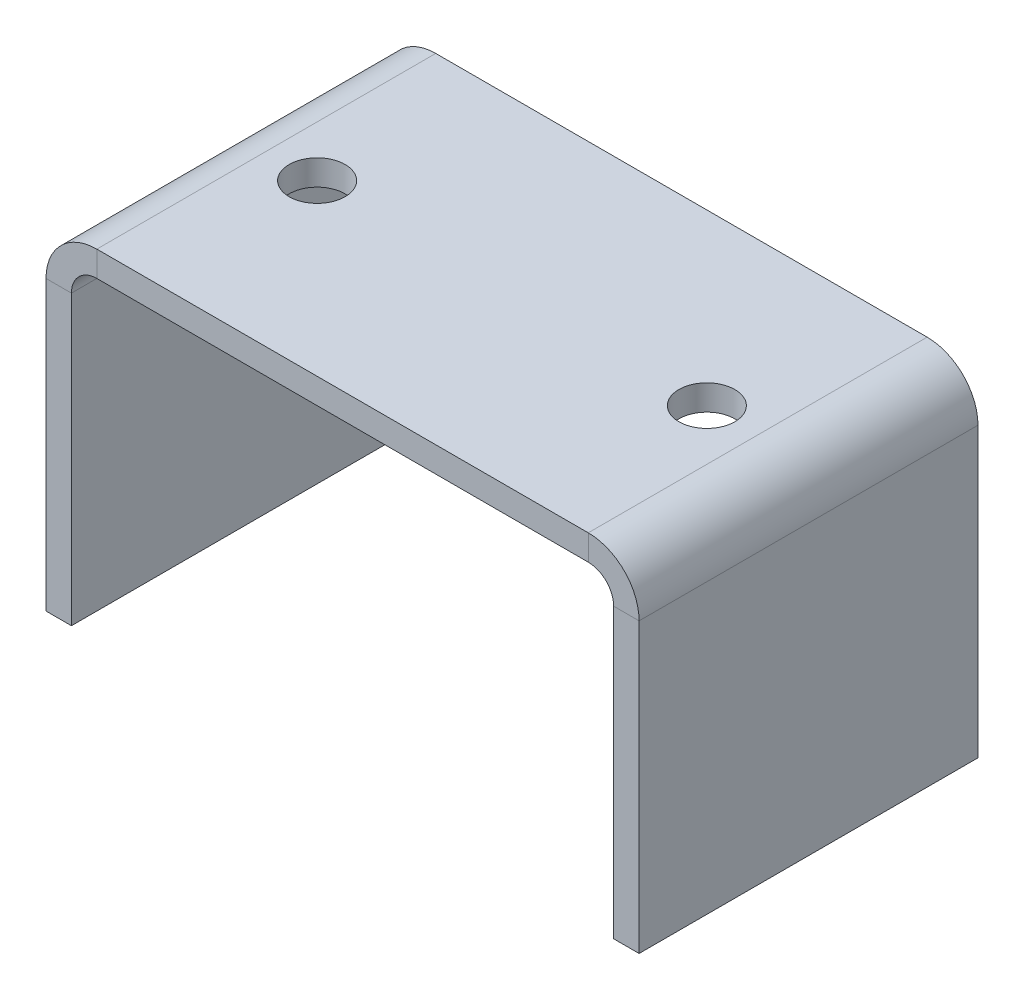
ISO-10303-21;
HEADER;
FILE_DESCRIPTION(('STEP AP214'),'2;1');
FILE_NAME('part.step','',(''),(''),'','','');
FILE_SCHEMA(('AUTOMOTIVE_DESIGN { 1 0 10303 214 1 1 1 1 }'));
ENDSEC;
DATA;
#1=APPLICATION_CONTEXT('core data for automotive mechanical design processes');
#2=APPLICATION_PROTOCOL_DEFINITION('international standard','automotive_design',2000,#1);
#3=PRODUCT_CONTEXT('',#1,'mechanical');
#4=PRODUCT('Part','Part','',(#3));
#5=PRODUCT_RELATED_PRODUCT_CATEGORY('part','',(#4));
#6=PRODUCT_DEFINITION_FORMATION('','',#4);
#7=PRODUCT_DEFINITION_CONTEXT('part definition',#1,'design');
#8=PRODUCT_DEFINITION('design','',#6,#7);
#9=PRODUCT_DEFINITION_SHAPE('','',#8);
#10=(LENGTH_UNIT() NAMED_UNIT(*) SI_UNIT(.MILLI.,.METRE.));
#11=(NAMED_UNIT(*) PLANE_ANGLE_UNIT() SI_UNIT($,.RADIAN.));
#12=(NAMED_UNIT(*) SI_UNIT($,.STERADIAN.) SOLID_ANGLE_UNIT());
#13=UNCERTAINTY_MEASURE_WITH_UNIT(LENGTH_MEASURE(1.E-05),#10,'distance_accuracy_value','');
#14=(GEOMETRIC_REPRESENTATION_CONTEXT(3) GLOBAL_UNCERTAINTY_ASSIGNED_CONTEXT((#13)) GLOBAL_UNIT_ASSIGNED_CONTEXT((#10,
#11,#12)) REPRESENTATION_CONTEXT('',''));
#15=CARTESIAN_POINT('',(0.,0.,0.));
#16=DIRECTION('',(0.,0.,1.));
#17=DIRECTION('',(1.,0.,0.));
#18=AXIS2_PLACEMENT_3D('',#15,#16,#17);
#19=CARTESIAN_POINT('',(6.,40.,20.));
#20=DIRECTION('',(0.,0.,1.));
#21=DIRECTION('',(1.,0.,0.));
#22=AXIS2_PLACEMENT_3D('',#19,#20,#21);
#23=PLANE('',#22);
#24=DIRECTION('',(0.,-1.,0.));
#25=VECTOR('',#24,1.);
#26=CARTESIAN_POINT('',(6.,40.,20.));
#27=LINE('',#26,#25);
#28=CARTESIAN_POINT('',(6.,40.,20.));
#29=VERTEX_POINT('',#28);
#30=CARTESIAN_POINT('',(6.,37.,20.));
#31=VERTEX_POINT('',#30);
#32=EDGE_CURVE('E11',#29,#31,#27,.T.);
#33=ORIENTED_EDGE('',*,*,#32,.F.);
#34=CARTESIAN_POINT('',(6.,34.,20.));
#35=DIRECTION('',(0.,0.,1.));
#36=DIRECTION('',(1.,0.,0.));
#37=AXIS2_PLACEMENT_3D('',#34,#35,#36);
#38=CIRCLE('',#37,6.);
#39=CARTESIAN_POINT('',(0.,34.,20.));
#40=VERTEX_POINT('',#39);
#41=EDGE_CURVE('E250',#40,#29,#38,.F.);
#42=ORIENTED_EDGE('',*,*,#41,.F.);
#43=DIRECTION('',(-1.,0.,0.));
#44=VECTOR('',#43,1.);
#45=CARTESIAN_POINT('',(3.,34.,20.));
#46=LINE('',#45,#44);
#47=CARTESIAN_POINT('',(3.,34.,20.));
#48=VERTEX_POINT('',#47);
#49=EDGE_CURVE('E47',#48,#40,#46,.T.);
#50=ORIENTED_EDGE('',*,*,#49,.F.);
#51=CARTESIAN_POINT('',(6.,34.,20.));
#52=DIRECTION('',(0.,0.,1.));
#53=DIRECTION('',(1.,0.,0.));
#54=AXIS2_PLACEMENT_3D('',#51,#52,#53);
#55=CIRCLE('',#54,3.);
#56=EDGE_CURVE('E148',#48,#31,#55,.F.);
#57=ORIENTED_EDGE('',*,*,#56,.T.);
#58=EDGE_LOOP('',(#33,#42,#50,#57));
#59=FACE_BOUND('',#58,.T.);
#60=ADVANCED_FACE('F39',(#59),#23,.T.);
#61=CARTESIAN_POINT('',(3.,34.,20.));
#62=DIRECTION('',(0.,0.,1.));
#63=DIRECTION('',(1.,0.,0.));
#64=AXIS2_PLACEMENT_3D('',#61,#62,#63);
#65=PLANE('',#64);
#66=DIRECTION('',(1.,0.,0.));
#67=VECTOR('',#66,1.);
#68=CARTESIAN_POINT('',(0.,40.,20.));
#69=LINE('',#68,#67);
#70=CARTESIAN_POINT('',(64.,40.,20.));
#71=VERTEX_POINT('',#70);
#72=EDGE_CURVE('E142',#29,#71,#69,.T.);
#73=ORIENTED_EDGE('',*,*,#72,.F.);
#74=ORIENTED_EDGE('',*,*,#32,.T.);
#75=DIRECTION('',(1.,0.,0.));
#76=VECTOR('',#75,1.);
#77=CARTESIAN_POINT('',(0.,37.,20.));
#78=LINE('',#77,#76);
#79=CARTESIAN_POINT('',(64.,37.,20.));
#80=VERTEX_POINT('',#79);
#81=EDGE_CURVE('E139',#31,#80,#78,.T.);
#82=ORIENTED_EDGE('',*,*,#81,.T.);
#83=DIRECTION('',(0.,1.,0.));
#84=VECTOR('',#83,1.);
#85=CARTESIAN_POINT('',(64.,37.,20.));
#86=LINE('',#85,#84);
#87=EDGE_CURVE('E231',#80,#71,#86,.T.);
#88=ORIENTED_EDGE('',*,*,#87,.T.);
#89=EDGE_LOOP('',(#73,#74,#82,#88));
#90=FACE_BOUND('',#89,.T.);
#91=ADVANCED_FACE('F137',(#90),#65,.T.);
#92=CARTESIAN_POINT('',(0.,34.,-20.));
#93=DIRECTION('',(0.,0.,-1.));
#94=DIRECTION('',(-1.,0.,0.));
#95=AXIS2_PLACEMENT_3D('',#92,#93,#94);
#96=PLANE('',#95);
#97=DIRECTION('',(1.,0.,0.));
#98=VECTOR('',#97,1.);
#99=CARTESIAN_POINT('',(0.,34.,-20.));
#100=LINE('',#99,#98);
#101=CARTESIAN_POINT('',(0.,34.,-20.));
#102=VERTEX_POINT('',#101);
#103=CARTESIAN_POINT('',(3.,34.,-20.));
#104=VERTEX_POINT('',#103);
#105=EDGE_CURVE('E236',#102,#104,#100,.T.);
#106=ORIENTED_EDGE('',*,*,#105,.F.);
#107=CARTESIAN_POINT('',(6.,34.,-20.));
#108=DIRECTION('',(0.,0.,1.));
#109=DIRECTION('',(1.,0.,0.));
#110=AXIS2_PLACEMENT_3D('',#107,#108,#109);
#111=CIRCLE('',#110,6.);
#112=CARTESIAN_POINT('',(6.,40.,-20.));
#113=VERTEX_POINT('',#112);
#114=EDGE_CURVE('E188',#102,#113,#111,.F.);
#115=ORIENTED_EDGE('',*,*,#114,.T.);
#116=DIRECTION('',(0.,1.,0.));
#117=VECTOR('',#116,1.);
#118=CARTESIAN_POINT('',(6.,37.,-20.));
#119=LINE('',#118,#117);
#120=CARTESIAN_POINT('',(6.,37.,-20.));
#121=VERTEX_POINT('',#120);
#122=EDGE_CURVE('E234',#121,#113,#119,.T.);
#123=ORIENTED_EDGE('',*,*,#122,.F.);
#124=CARTESIAN_POINT('',(6.,34.,-20.));
#125=DIRECTION('',(0.,0.,1.));
#126=DIRECTION('',(1.,0.,0.));
#127=AXIS2_PLACEMENT_3D('',#124,#125,#126);
#128=CIRCLE('',#127,3.);
#129=EDGE_CURVE('E160',#104,#121,#128,.F.);
#130=ORIENTED_EDGE('',*,*,#129,.F.);
#131=EDGE_LOOP('',(#106,#115,#123,#130));
#132=FACE_BOUND('',#131,.T.);
#133=ADVANCED_FACE('F296',(#132),#96,.T.);
#134=CARTESIAN_POINT('',(6.,37.,-20.));
#135=DIRECTION('',(0.,0.,-1.));
#136=DIRECTION('',(-1.,0.,0.));
#137=AXIS2_PLACEMENT_3D('',#134,#135,#136);
#138=PLANE('',#137);
#139=DIRECTION('',(0.,1.,0.));
#140=VECTOR('',#139,1.);
#141=CARTESIAN_POINT('',(0.,0.,-20.));
#142=LINE('',#141,#140);
#143=CARTESIAN_POINT('',(0.,0.,-20.));
#144=VERTEX_POINT('',#143);
#145=EDGE_CURVE('E191',#144,#102,#142,.T.);
#146=ORIENTED_EDGE('',*,*,#145,.T.);
#147=ORIENTED_EDGE('',*,*,#105,.T.);
#148=DIRECTION('',(0.,1.,0.));
#149=VECTOR('',#148,1.);
#150=CARTESIAN_POINT('',(3.,0.,-20.));
#151=LINE('',#150,#149);
#152=CARTESIAN_POINT('',(3.,0.,-20.));
#153=VERTEX_POINT('',#152);
#154=EDGE_CURVE('E197',#153,#104,#151,.T.);
#155=ORIENTED_EDGE('',*,*,#154,.F.);
#156=DIRECTION('',(-1.,0.,0.));
#157=VECTOR('',#156,1.);
#158=CARTESIAN_POINT('',(3.,0.,-20.));
#159=LINE('',#158,#157);
#160=EDGE_CURVE('E194',#153,#144,#159,.T.);
#161=ORIENTED_EDGE('',*,*,#160,.T.);
#162=EDGE_LOOP('',(#146,#147,#155,#161));
#163=FACE_BOUND('',#162,.T.);
#164=ADVANCED_FACE('F299',(#163),#138,.T.);
#165=CARTESIAN_POINT('',(70.,34.,20.));
#166=DIRECTION('',(0.,0.,1.));
#167=DIRECTION('',(1.,0.,0.));
#168=AXIS2_PLACEMENT_3D('',#165,#166,#167);
#169=PLANE('',#168);
#170=DIRECTION('',(-1.,0.,0.));
#171=VECTOR('',#170,1.);
#172=CARTESIAN_POINT('',(70.,34.,20.));
#173=LINE('',#172,#171);
#174=CARTESIAN_POINT('',(70.,34.,20.));
#175=VERTEX_POINT('',#174);
#176=CARTESIAN_POINT('',(67.,34.,20.));
#177=VERTEX_POINT('',#176);
#178=EDGE_CURVE('E55',#175,#177,#173,.T.);
#179=ORIENTED_EDGE('',*,*,#178,.F.);
#180=CARTESIAN_POINT('',(64.,34.,20.));
#181=DIRECTION('',(0.,0.,1.));
#182=DIRECTION('',(1.,0.,0.));
#183=AXIS2_PLACEMENT_3D('',#180,#181,#182);
#184=CIRCLE('',#183,6.);
#185=EDGE_CURVE('E260',#71,#175,#184,.F.);
#186=ORIENTED_EDGE('',*,*,#185,.F.);
#187=ORIENTED_EDGE('',*,*,#87,.F.);
#188=CARTESIAN_POINT('',(64.,34.,20.));
#189=DIRECTION('',(0.,0.,1.));
#190=DIRECTION('',(1.,0.,0.));
#191=AXIS2_PLACEMENT_3D('',#188,#189,#190);
#192=CIRCLE('',#191,3.);
#193=EDGE_CURVE('E168',#80,#177,#192,.F.);
#194=ORIENTED_EDGE('',*,*,#193,.T.);
#195=EDGE_LOOP('',(#179,#186,#187,#194));
#196=FACE_BOUND('',#195,.T.);
#197=ADVANCED_FACE('F324',(#196),#169,.T.);
#198=CARTESIAN_POINT('',(64.,37.,20.));
#199=DIRECTION('',(0.,0.,1.));
#200=DIRECTION('',(1.,0.,0.));
#201=AXIS2_PLACEMENT_3D('',#198,#199,#200);
#202=PLANE('',#201);
#203=DIRECTION('',(0.,-1.,0.));
#204=VECTOR('',#203,1.);
#205=CARTESIAN_POINT('',(70.,40.,20.));
#206=LINE('',#205,#204);
#207=CARTESIAN_POINT('',(70.,0.,20.));
#208=VERTEX_POINT('',#207);
#209=EDGE_CURVE('E263',#175,#208,#206,.T.);
#210=ORIENTED_EDGE('',*,*,#209,.F.);
#211=ORIENTED_EDGE('',*,*,#178,.T.);
#212=DIRECTION('',(0.,1.,0.));
#213=VECTOR('',#212,1.);
#214=CARTESIAN_POINT('',(67.,40.,20.));
#215=LINE('',#214,#213);
#216=CARTESIAN_POINT('',(67.,0.,20.));
#217=VERTEX_POINT('',#216);
#218=EDGE_CURVE('E109',#177,#217,#215,.F.);
#219=ORIENTED_EDGE('',*,*,#218,.T.);
#220=DIRECTION('',(-1.,0.,0.));
#221=VECTOR('',#220,1.);
#222=CARTESIAN_POINT('',(70.,0.,20.));
#223=LINE('',#222,#221);
#224=EDGE_CURVE('E266',#208,#217,#223,.T.);
#225=ORIENTED_EDGE('',*,*,#224,.F.);
#226=EDGE_LOOP('',(#210,#211,#219,#225));
#227=FACE_BOUND('',#226,.T.);
#228=ADVANCED_FACE('F327',(#227),#202,.T.);
#229=CARTESIAN_POINT('',(64.,40.,-20.));
#230=DIRECTION('',(0.,0.,-1.));
#231=DIRECTION('',(-1.,0.,0.));
#232=AXIS2_PLACEMENT_3D('',#229,#230,#231);
#233=PLANE('',#232);
#234=DIRECTION('',(0.,-1.,0.));
#235=VECTOR('',#234,1.);
#236=CARTESIAN_POINT('',(64.,40.,-20.));
#237=LINE('',#236,#235);
#238=CARTESIAN_POINT('',(64.,40.,-20.));
#239=VERTEX_POINT('',#238);
#240=CARTESIAN_POINT('',(64.,37.,-20.));
#241=VERTEX_POINT('',#240);
#242=EDGE_CURVE('E96',#239,#241,#237,.T.);
#243=ORIENTED_EDGE('',*,*,#242,.F.);
#244=CARTESIAN_POINT('',(64.,34.,-20.));
#245=DIRECTION('',(0.,0.,1.));
#246=DIRECTION('',(1.,0.,0.));
#247=AXIS2_PLACEMENT_3D('',#244,#245,#246);
#248=CIRCLE('',#247,6.);
#249=CARTESIAN_POINT('',(70.,34.,-20.));
#250=VERTEX_POINT('',#249);
#251=EDGE_CURVE('E184',#239,#250,#248,.F.);
#252=ORIENTED_EDGE('',*,*,#251,.T.);
#253=DIRECTION('',(1.,0.,0.));
#254=VECTOR('',#253,1.);
#255=CARTESIAN_POINT('',(67.,34.,-20.));
#256=LINE('',#255,#254);
#257=CARTESIAN_POINT('',(67.,34.,-20.));
#258=VERTEX_POINT('',#257);
#259=EDGE_CURVE('E103',#258,#250,#256,.T.);
#260=ORIENTED_EDGE('',*,*,#259,.F.);
#261=CARTESIAN_POINT('',(64.,34.,-20.));
#262=DIRECTION('',(0.,0.,1.));
#263=DIRECTION('',(1.,0.,0.));
#264=AXIS2_PLACEMENT_3D('',#261,#262,#263);
#265=CIRCLE('',#264,3.);
#266=EDGE_CURVE('E203',#241,#258,#265,.F.);
#267=ORIENTED_EDGE('',*,*,#266,.F.);
#268=EDGE_LOOP('',(#243,#252,#260,#267));
#269=FACE_BOUND('',#268,.T.);
#270=ADVANCED_FACE('F331',(#269),#233,.T.);
#271=CARTESIAN_POINT('',(67.,34.,-20.));
#272=DIRECTION('',(0.,0.,-1.));
#273=DIRECTION('',(-1.,0.,0.));
#274=AXIS2_PLACEMENT_3D('',#271,#272,#273);
#275=PLANE('',#274);
#276=DIRECTION('',(1.,0.,0.));
#277=VECTOR('',#276,1.);
#278=CARTESIAN_POINT('',(0.,40.,-20.));
#279=LINE('',#278,#277);
#280=EDGE_CURVE('E186',#113,#239,#279,.T.);
#281=ORIENTED_EDGE('',*,*,#280,.T.);
#282=ORIENTED_EDGE('',*,*,#242,.T.);
#283=DIRECTION('',(1.,0.,0.));
#284=VECTOR('',#283,1.);
#285=CARTESIAN_POINT('',(0.,37.,-20.));
#286=LINE('',#285,#284);
#287=EDGE_CURVE('E201',#121,#241,#286,.T.);
#288=ORIENTED_EDGE('',*,*,#287,.F.);
#289=ORIENTED_EDGE('',*,*,#122,.T.);
#290=EDGE_LOOP('',(#281,#282,#288,#289));
#291=FACE_BOUND('',#290,.T.);
#292=ADVANCED_FACE('F334',(#291),#275,.T.);
#293=CARTESIAN_POINT('',(67.,40.,20.));
#294=DIRECTION('',(1.,0.,0.));
#295=DIRECTION('',(0.,0.,-1.));
#296=AXIS2_PLACEMENT_3D('',#293,#294,#295);
#297=PLANE('',#296);
#298=DIRECTION('',(0.,1.,0.));
#299=VECTOR('',#298,1.);
#300=CARTESIAN_POINT('',(67.,40.,-20.));
#301=LINE('',#300,#299);
#302=CARTESIAN_POINT('',(67.,0.,-20.));
#303=VERTEX_POINT('',#302);
#304=EDGE_CURVE('E174',#258,#303,#301,.F.);
#305=ORIENTED_EDGE('',*,*,#304,.T.);
#306=DIRECTION('',(0.,0.,-1.));
#307=VECTOR('',#306,1.);
#308=CARTESIAN_POINT('',(67.,0.,20.));
#309=LINE('',#308,#307);
#310=EDGE_CURVE('E227',#217,#303,#309,.T.);
#311=ORIENTED_EDGE('',*,*,#310,.F.);
#312=ORIENTED_EDGE('',*,*,#218,.F.);
#313=DIRECTION('',(0.,0.,-1.));
#314=VECTOR('',#313,1.);
#315=CARTESIAN_POINT('',(67.,34.,20.));
#316=LINE('',#315,#314);
#317=EDGE_CURVE('E170',#177,#258,#316,.T.);
#318=ORIENTED_EDGE('',*,*,#317,.T.);
#319=EDGE_LOOP('',(#305,#311,#312,#318));
#320=FACE_BOUND('',#319,.T.);
#321=ADVANCED_FACE('F337',(#320),#297,.F.);
#322=CARTESIAN_POINT('',(70.,0.,20.));
#323=DIRECTION('',(0.,-1.,0.));
#324=DIRECTION('',(0.,0.,-1.));
#325=AXIS2_PLACEMENT_3D('',#322,#323,#324);
#326=PLANE('',#325);
#327=DIRECTION('',(-1.,0.,0.));
#328=VECTOR('',#327,1.);
#329=CARTESIAN_POINT('',(70.,0.,-20.));
#330=LINE('',#329,#328);
#331=CARTESIAN_POINT('',(70.,0.,-20.));
#332=VERTEX_POINT('',#331);
#333=EDGE_CURVE('E177',#332,#303,#330,.T.);
#334=ORIENTED_EDGE('',*,*,#333,.F.);
#335=DIRECTION('',(0.,0.,-1.));
#336=VECTOR('',#335,1.);
#337=CARTESIAN_POINT('',(70.,0.,20.));
#338=LINE('',#337,#336);
#339=EDGE_CURVE('E225',#208,#332,#338,.T.);
#340=ORIENTED_EDGE('',*,*,#339,.F.);
#341=ORIENTED_EDGE('',*,*,#224,.T.);
#342=ORIENTED_EDGE('',*,*,#310,.T.);
#343=EDGE_LOOP('',(#334,#340,#341,#342));
#344=FACE_BOUND('',#343,.T.);
#345=ADVANCED_FACE('F340',(#344),#326,.T.);
#346=CARTESIAN_POINT('',(70.,40.,20.));
#347=DIRECTION('',(1.,0.,0.));
#348=DIRECTION('',(0.,0.,-1.));
#349=AXIS2_PLACEMENT_3D('',#346,#347,#348);
#350=PLANE('',#349);
#351=DIRECTION('',(0.,-1.,0.));
#352=VECTOR('',#351,1.);
#353=CARTESIAN_POINT('',(70.,40.,-20.));
#354=LINE('',#353,#352);
#355=EDGE_CURVE('E181',#250,#332,#354,.T.);
#356=ORIENTED_EDGE('',*,*,#355,.F.);
#357=DIRECTION('',(0.,0.,-1.));
#358=VECTOR('',#357,1.);
#359=CARTESIAN_POINT('',(70.,34.,20.));
#360=LINE('',#359,#358);
#361=EDGE_CURVE('E222',#175,#250,#360,.T.);
#362=ORIENTED_EDGE('',*,*,#361,.F.);
#363=ORIENTED_EDGE('',*,*,#209,.T.);
#364=ORIENTED_EDGE('',*,*,#339,.T.);
#365=EDGE_LOOP('',(#356,#362,#363,#364));
#366=FACE_BOUND('',#365,.T.);
#367=ADVANCED_FACE('F344',(#366),#350,.T.);
#368=CARTESIAN_POINT('',(64.,34.,20.));
#369=DIRECTION('',(0.,0.,-1.));
#370=DIRECTION('',(-1.,0.,0.));
#371=AXIS2_PLACEMENT_3D('',#368,#369,#370);
#372=CYLINDRICAL_SURFACE('',#371,6.);
#373=ORIENTED_EDGE('',*,*,#251,.F.);
#374=DIRECTION('',(0.,0.,-1.));
#375=VECTOR('',#374,1.);
#376=CARTESIAN_POINT('',(64.,40.,20.));
#377=LINE('',#376,#375);
#378=EDGE_CURVE('E219',#71,#239,#377,.T.);
#379=ORIENTED_EDGE('',*,*,#378,.F.);
#380=ORIENTED_EDGE('',*,*,#185,.T.);
#381=ORIENTED_EDGE('',*,*,#361,.T.);
#382=EDGE_LOOP('',(#373,#379,#380,#381));
#383=FACE_BOUND('',#382,.T.);
#384=ADVANCED_FACE('F288',(#383),#372,.T.);
#385=CARTESIAN_POINT('',(0.,40.,20.));
#386=DIRECTION('',(0.,1.,0.));
#387=DIRECTION('',(0.,0.,1.));
#388=AXIS2_PLACEMENT_3D('',#385,#386,#387);
#389=PLANE('',#388);
#390=CARTESIAN_POINT('',(12.,40.,0.));
#391=DIRECTION('',(0.,1.,0.));
#392=DIRECTION('',(0.,0.,1.));
#393=AXIS2_PLACEMENT_3D('',#390,#391,#392);
#394=CIRCLE('',#393,3.3);
#395=CARTESIAN_POINT('',(12.,40.,3.3));
#396=VERTEX_POINT('',#395);
#397=EDGE_CURVE('E278',#396,#396,#394,.T.);
#398=ORIENTED_EDGE('',*,*,#397,.F.);
#399=EDGE_LOOP('',(#398));
#400=FACE_BOUND('',#399,.T.);
#401=CARTESIAN_POINT('',(58.,40.,0.));
#402=DIRECTION('',(0.,1.,0.));
#403=DIRECTION('',(0.,0.,1.));
#404=AXIS2_PLACEMENT_3D('',#401,#402,#403);
#405=CIRCLE('',#404,3.3);
#406=CARTESIAN_POINT('',(58.,40.,3.3));
#407=VERTEX_POINT('',#406);
#408=EDGE_CURVE('E272',#407,#407,#405,.T.);
#409=ORIENTED_EDGE('',*,*,#408,.F.);
#410=EDGE_LOOP('',(#409));
#411=FACE_BOUND('',#410,.T.);
#412=ORIENTED_EDGE('',*,*,#280,.F.);
#413=DIRECTION('',(0.,0.,-1.));
#414=VECTOR('',#413,1.);
#415=CARTESIAN_POINT('',(6.,40.,20.));
#416=LINE('',#415,#414);
#417=EDGE_CURVE('E216',#29,#113,#416,.T.);
#418=ORIENTED_EDGE('',*,*,#417,.F.);
#419=ORIENTED_EDGE('',*,*,#72,.T.);
#420=ORIENTED_EDGE('',*,*,#378,.T.);
#421=EDGE_LOOP('',(#412,#418,#419,#420));
#422=FACE_BOUND('',#421,.T.);
#423=ADVANCED_FACE('F285',(#400,#411,#422),#389,.T.);
#424=CARTESIAN_POINT('',(6.,34.,20.));
#425=DIRECTION('',(0.,0.,-1.));
#426=DIRECTION('',(-1.,0.,0.));
#427=AXIS2_PLACEMENT_3D('',#424,#425,#426);
#428=CYLINDRICAL_SURFACE('',#427,6.);
#429=ORIENTED_EDGE('',*,*,#114,.F.);
#430=DIRECTION('',(0.,0.,-1.));
#431=VECTOR('',#430,1.);
#432=CARTESIAN_POINT('',(0.,34.,20.));
#433=LINE('',#432,#431);
#434=EDGE_CURVE('E213',#40,#102,#433,.T.);
#435=ORIENTED_EDGE('',*,*,#434,.F.);
#436=ORIENTED_EDGE('',*,*,#41,.T.);
#437=ORIENTED_EDGE('',*,*,#417,.T.);
#438=EDGE_LOOP('',(#429,#435,#436,#437));
#439=FACE_BOUND('',#438,.T.);
#440=ADVANCED_FACE('F249',(#439),#428,.T.);
#441=CARTESIAN_POINT('',(0.,0.,20.));
#442=DIRECTION('',(-1.,0.,0.));
#443=DIRECTION('',(0.,0.,1.));
#444=AXIS2_PLACEMENT_3D('',#441,#442,#443);
#445=PLANE('',#444);
#446=ORIENTED_EDGE('',*,*,#145,.F.);
#447=DIRECTION('',(0.,0.,-1.));
#448=VECTOR('',#447,1.);
#449=CARTESIAN_POINT('',(0.,0.,20.));
#450=LINE('',#449,#448);
#451=CARTESIAN_POINT('',(0.,0.,20.));
#452=VERTEX_POINT('',#451);
#453=EDGE_CURVE('E211',#452,#144,#450,.T.);
#454=ORIENTED_EDGE('',*,*,#453,.F.);
#455=DIRECTION('',(0.,1.,0.));
#456=VECTOR('',#455,1.);
#457=CARTESIAN_POINT('',(0.,0.,20.));
#458=LINE('',#457,#456);
#459=EDGE_CURVE('E243',#452,#40,#458,.T.);
#460=ORIENTED_EDGE('',*,*,#459,.T.);
#461=ORIENTED_EDGE('',*,*,#434,.T.);
#462=EDGE_LOOP('',(#446,#454,#460,#461));
#463=FACE_BOUND('',#462,.T.);
#464=ADVANCED_FACE('F254',(#463),#445,.T.);
#465=CARTESIAN_POINT('',(3.,0.,20.));
#466=DIRECTION('',(0.,-1.,0.));
#467=DIRECTION('',(0.,0.,-1.));
#468=AXIS2_PLACEMENT_3D('',#465,#466,#467);
#469=PLANE('',#468);
#470=ORIENTED_EDGE('',*,*,#160,.F.);
#471=DIRECTION('',(0.,0.,-1.));
#472=VECTOR('',#471,1.);
#473=CARTESIAN_POINT('',(3.,0.,20.));
#474=LINE('',#473,#472);
#475=CARTESIAN_POINT('',(3.,0.,20.));
#476=VERTEX_POINT('',#475);
#477=EDGE_CURVE('E209',#476,#153,#474,.T.);
#478=ORIENTED_EDGE('',*,*,#477,.F.);
#479=DIRECTION('',(-1.,0.,0.));
#480=VECTOR('',#479,1.);
#481=CARTESIAN_POINT('',(3.,0.,20.));
#482=LINE('',#481,#480);
#483=EDGE_CURVE('E255',#476,#452,#482,.T.);
#484=ORIENTED_EDGE('',*,*,#483,.T.);
#485=ORIENTED_EDGE('',*,*,#453,.T.);
#486=EDGE_LOOP('',(#470,#478,#484,#485));
#487=FACE_BOUND('',#486,.T.);
#488=ADVANCED_FACE('F304',(#487),#469,.T.);
#489=CARTESIAN_POINT('',(3.,0.,20.));
#490=DIRECTION('',(-1.,0.,0.));
#491=DIRECTION('',(0.,0.,1.));
#492=AXIS2_PLACEMENT_3D('',#489,#490,#491);
#493=PLANE('',#492);
#494=ORIENTED_EDGE('',*,*,#154,.T.);
#495=DIRECTION('',(0.,0.,-1.));
#496=VECTOR('',#495,1.);
#497=CARTESIAN_POINT('',(3.,34.,20.));
#498=LINE('',#497,#496);
#499=EDGE_CURVE('E162',#48,#104,#498,.T.);
#500=ORIENTED_EDGE('',*,*,#499,.F.);
#501=DIRECTION('',(0.,1.,0.));
#502=VECTOR('',#501,1.);
#503=CARTESIAN_POINT('',(3.,0.,20.));
#504=LINE('',#503,#502);
#505=EDGE_CURVE('E153',#476,#48,#504,.T.);
#506=ORIENTED_EDGE('',*,*,#505,.F.);
#507=ORIENTED_EDGE('',*,*,#477,.T.);
#508=EDGE_LOOP('',(#494,#500,#506,#507));
#509=FACE_BOUND('',#508,.T.);
#510=ADVANCED_FACE('F302',(#509),#493,.F.);
#511=CARTESIAN_POINT('',(6.,34.,20.));
#512=DIRECTION('',(0.,0.,-1.));
#513=DIRECTION('',(-1.,0.,0.));
#514=AXIS2_PLACEMENT_3D('',#511,#512,#513);
#515=CYLINDRICAL_SURFACE('',#514,3.);
#516=ORIENTED_EDGE('',*,*,#129,.T.);
#517=DIRECTION('',(0.,0.,-1.));
#518=VECTOR('',#517,1.);
#519=CARTESIAN_POINT('',(6.,37.,20.));
#520=LINE('',#519,#518);
#521=EDGE_CURVE('E157',#31,#121,#520,.T.);
#522=ORIENTED_EDGE('',*,*,#521,.F.);
#523=ORIENTED_EDGE('',*,*,#56,.F.);
#524=ORIENTED_EDGE('',*,*,#499,.T.);
#525=EDGE_LOOP('',(#516,#522,#523,#524));
#526=FACE_BOUND('',#525,.T.);
#527=ADVANCED_FACE('F158',(#526),#515,.F.);
#528=CARTESIAN_POINT('',(0.,37.,20.));
#529=DIRECTION('',(0.,1.,0.));
#530=DIRECTION('',(0.,0.,1.));
#531=AXIS2_PLACEMENT_3D('',#528,#529,#530);
#532=PLANE('',#531);
#533=CARTESIAN_POINT('',(12.,37.,0.));
#534=DIRECTION('',(0.,1.,0.));
#535=DIRECTION('',(0.,0.,1.));
#536=AXIS2_PLACEMENT_3D('',#533,#534,#535);
#537=CIRCLE('',#536,3.29999999999999);
#538=CARTESIAN_POINT('',(12.,37.,3.29999999999999));
#539=VERTEX_POINT('',#538);
#540=EDGE_CURVE('E275',#539,#539,#537,.T.);
#541=ORIENTED_EDGE('',*,*,#540,.T.);
#542=EDGE_LOOP('',(#541));
#543=FACE_BOUND('',#542,.T.);
#544=CARTESIAN_POINT('',(58.,37.,0.));
#545=DIRECTION('',(0.,1.,0.));
#546=DIRECTION('',(0.,0.,1.));
#547=AXIS2_PLACEMENT_3D('',#544,#545,#546);
#548=CIRCLE('',#547,3.29999999999999);
#549=CARTESIAN_POINT('',(58.,37.,3.29999999999999));
#550=VERTEX_POINT('',#549);
#551=EDGE_CURVE('E178',#550,#550,#548,.T.);
#552=ORIENTED_EDGE('',*,*,#551,.T.);
#553=EDGE_LOOP('',(#552));
#554=FACE_BOUND('',#553,.T.);
#555=ORIENTED_EDGE('',*,*,#287,.T.);
#556=DIRECTION('',(0.,0.,-1.));
#557=VECTOR('',#556,1.);
#558=CARTESIAN_POINT('',(64.,37.,20.));
#559=LINE('',#558,#557);
#560=EDGE_CURVE('E163',#80,#241,#559,.T.);
#561=ORIENTED_EDGE('',*,*,#560,.F.);
#562=ORIENTED_EDGE('',*,*,#81,.F.);
#563=ORIENTED_EDGE('',*,*,#521,.T.);
#564=EDGE_LOOP('',(#555,#561,#562,#563));
#565=FACE_BOUND('',#564,.T.);
#566=ADVANCED_FACE('F165',(#543,#554,#565),#532,.F.);
#567=CARTESIAN_POINT('',(64.,34.,20.));
#568=DIRECTION('',(0.,0.,-1.));
#569=DIRECTION('',(-1.,0.,0.));
#570=AXIS2_PLACEMENT_3D('',#567,#568,#569);
#571=CYLINDRICAL_SURFACE('',#570,3.);
#572=ORIENTED_EDGE('',*,*,#266,.T.);
#573=ORIENTED_EDGE('',*,*,#317,.F.);
#574=ORIENTED_EDGE('',*,*,#193,.F.);
#575=ORIENTED_EDGE('',*,*,#560,.T.);
#576=EDGE_LOOP('',(#572,#573,#574,#575));
#577=FACE_BOUND('',#576,.T.);
#578=ADVANCED_FACE('F391',(#577),#571,.F.);
#579=CARTESIAN_POINT('',(64.,34.,20.));
#580=DIRECTION('',(0.,0.,1.));
#581=DIRECTION('',(1.,0.,0.));
#582=AXIS2_PLACEMENT_3D('',#579,#580,#581);
#583=PLANE('',#582);
#584=ORIENTED_EDGE('',*,*,#505,.T.);
#585=ORIENTED_EDGE('',*,*,#49,.T.);
#586=ORIENTED_EDGE('',*,*,#459,.F.);
#587=ORIENTED_EDGE('',*,*,#483,.F.);
#588=EDGE_LOOP('',(#584,#585,#586,#587));
#589=FACE_BOUND('',#588,.T.);
#590=ADVANCED_FACE('F240',(#589),#583,.T.);
#591=CARTESIAN_POINT('',(64.,34.,-20.));
#592=DIRECTION('',(0.,0.,1.));
#593=DIRECTION('',(1.,0.,0.));
#594=AXIS2_PLACEMENT_3D('',#591,#592,#593);
#595=PLANE('',#594);
#596=ORIENTED_EDGE('',*,*,#304,.F.);
#597=ORIENTED_EDGE('',*,*,#259,.T.);
#598=ORIENTED_EDGE('',*,*,#355,.T.);
#599=ORIENTED_EDGE('',*,*,#333,.T.);
#600=EDGE_LOOP('',(#596,#597,#598,#599));
#601=FACE_BOUND('',#600,.T.);
#602=ADVANCED_FACE('F406',(#601),#595,.F.);
#603=CARTESIAN_POINT('',(58.,40.,0.));
#604=DIRECTION('',(0.,1.,0.));
#605=DIRECTION('',(0.,0.,1.));
#606=AXIS2_PLACEMENT_3D('',#603,#604,#605);
#607=CYLINDRICAL_SURFACE('',#606,3.29999999999999);
#608=ORIENTED_EDGE('',*,*,#408,.T.);
#609=EDGE_LOOP('',(#608));
#610=FACE_BOUND('',#609,.T.);
#611=ORIENTED_EDGE('',*,*,#551,.F.);
#612=EDGE_LOOP('',(#611));
#613=FACE_BOUND('',#612,.T.);
#614=ADVANCED_FACE('F415',(#610,#613),#607,.F.);
#615=CARTESIAN_POINT('',(12.,40.,0.));
#616=DIRECTION('',(0.,1.,0.));
#617=DIRECTION('',(0.,0.,1.));
#618=AXIS2_PLACEMENT_3D('',#615,#616,#617);
#619=CYLINDRICAL_SURFACE('',#618,3.29999999999999);
#620=ORIENTED_EDGE('',*,*,#397,.T.);
#621=EDGE_LOOP('',(#620));
#622=FACE_BOUND('',#621,.T.);
#623=ORIENTED_EDGE('',*,*,#540,.F.);
#624=EDGE_LOOP('',(#623));
#625=FACE_BOUND('',#624,.T.);
#626=ADVANCED_FACE('F282',(#622,#625),#619,.F.);
#627=CLOSED_SHELL('',(#60,#91,#133,#164,#197,#228,#270,#292,#321,#345,#367,#384,#423,#440,#464,
#488,#510,#527,#566,#578,#590,#602,#614,#626));
#628=MANIFOLD_SOLID_BREP('B2',#627);
#629=ADVANCED_BREP_SHAPE_REPRESENTATION('',(#18,#628),#14);
#630=SHAPE_DEFINITION_REPRESENTATION(#9,#629);
ENDSEC;
END-ISO-10303-21;
